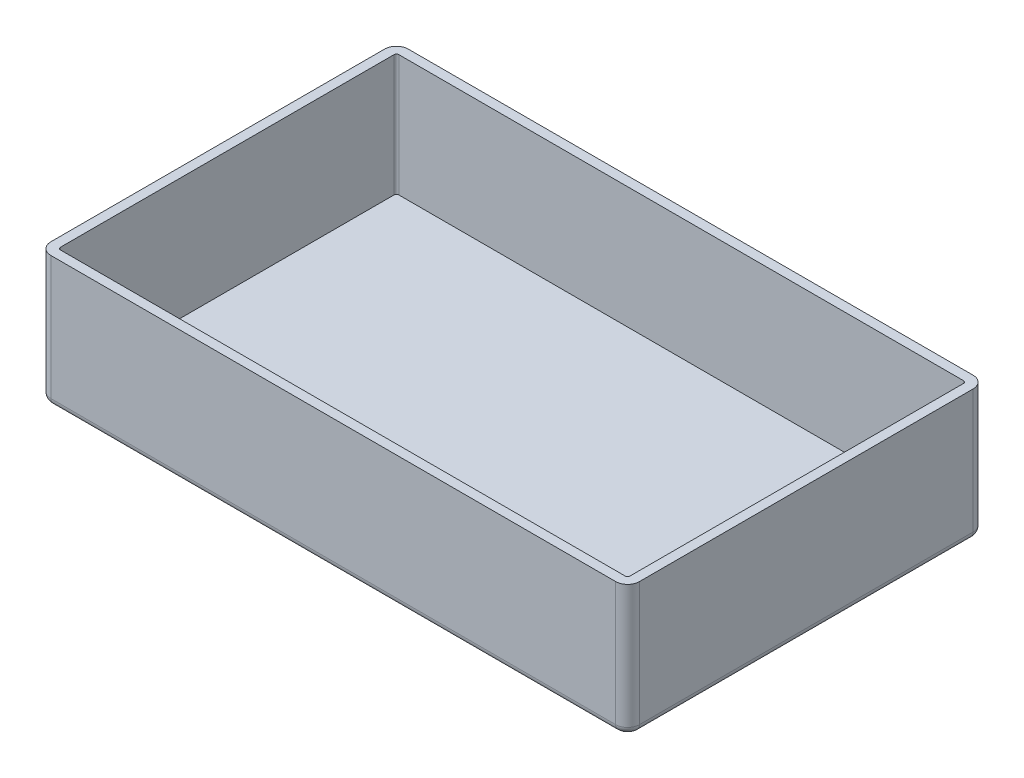
ISO-10303-21;
HEADER;
FILE_DESCRIPTION(('STEP AP214'),'2;1');
FILE_NAME('part.step','',(''),(''),'','','');
FILE_SCHEMA(('AUTOMOTIVE_DESIGN { 1 0 10303 214 1 1 1 1 }'));
ENDSEC;
DATA;
#1=APPLICATION_CONTEXT('core data for automotive mechanical design processes');
#2=APPLICATION_PROTOCOL_DEFINITION('international standard','automotive_design',2000,#1);
#3=PRODUCT_CONTEXT('',#1,'mechanical');
#4=PRODUCT('Part','Part','',(#3));
#5=PRODUCT_RELATED_PRODUCT_CATEGORY('part','',(#4));
#6=PRODUCT_DEFINITION_FORMATION('','',#4);
#7=PRODUCT_DEFINITION_CONTEXT('part definition',#1,'design');
#8=PRODUCT_DEFINITION('design','',#6,#7);
#9=PRODUCT_DEFINITION_SHAPE('','',#8);
#10=(LENGTH_UNIT() NAMED_UNIT(*) SI_UNIT(.MILLI.,.METRE.));
#11=(NAMED_UNIT(*) PLANE_ANGLE_UNIT() SI_UNIT($,.RADIAN.));
#12=(NAMED_UNIT(*) SI_UNIT($,.STERADIAN.) SOLID_ANGLE_UNIT());
#13=UNCERTAINTY_MEASURE_WITH_UNIT(LENGTH_MEASURE(1.E-05),#10,'distance_accuracy_value','');
#14=(GEOMETRIC_REPRESENTATION_CONTEXT(3) GLOBAL_UNCERTAINTY_ASSIGNED_CONTEXT((#13)) GLOBAL_UNIT_ASSIGNED_CONTEXT((#10,
#11,#12)) REPRESENTATION_CONTEXT('',''));
#15=CARTESIAN_POINT('',(0.,0.,0.));
#16=DIRECTION('',(0.,0.,1.));
#17=DIRECTION('',(1.,0.,0.));
#18=AXIS2_PLACEMENT_3D('',#15,#16,#17);
#19=CARTESIAN_POINT('',(123.5,55.,75.));
#20=DIRECTION('',(-1.,0.,0.));
#21=DIRECTION('',(0.,0.,1.));
#22=AXIS2_PLACEMENT_3D('',#19,#20,#21);
#23=PLANE('',#22);
#24=DIRECTION('',(0.,-1.,0.));
#25=VECTOR('',#24,1.);
#26=CARTESIAN_POINT('',(123.5,55.,70.));
#27=LINE('',#26,#25);
#28=CARTESIAN_POINT('',(123.5,55.,70.));
#29=VERTEX_POINT('',#28);
#30=CARTESIAN_POINT('',(123.5,3.,70.));
#31=VERTEX_POINT('',#30);
#32=EDGE_CURVE('E283',#29,#31,#27,.T.);
#33=ORIENTED_EDGE('',*,*,#32,.T.);
#34=DIRECTION('',(0.,0.,-1.));
#35=VECTOR('',#34,1.);
#36=CARTESIAN_POINT('',(123.5,3.,-70.));
#37=LINE('',#36,#35);
#38=CARTESIAN_POINT('',(123.5,3.,-70.));
#39=VERTEX_POINT('',#38);
#40=EDGE_CURVE('E308',#31,#39,#37,.T.);
#41=ORIENTED_EDGE('',*,*,#40,.T.);
#42=DIRECTION('',(0.,-1.,0.));
#43=VECTOR('',#42,1.);
#44=CARTESIAN_POINT('',(123.5,55.,-70.));
#45=LINE('',#44,#43);
#46=CARTESIAN_POINT('',(123.5,55.,-70.));
#47=VERTEX_POINT('',#46);
#48=EDGE_CURVE('E286',#39,#47,#45,.F.);
#49=ORIENTED_EDGE('',*,*,#48,.T.);
#50=DIRECTION('',(0.,0.,-1.));
#51=VECTOR('',#50,1.);
#52=CARTESIAN_POINT('',(123.5,55.,75.));
#53=LINE('',#52,#51);
#54=EDGE_CURVE('E249',#29,#47,#53,.T.);
#55=ORIENTED_EDGE('',*,*,#54,.F.);
#56=EDGE_LOOP('',(#33,#41,#49,#55));
#57=FACE_BOUND('',#56,.T.);
#58=ADVANCED_FACE('F43',(#57),#23,.F.);
#59=CARTESIAN_POINT('',(-123.5,55.,-75.));
#60=DIRECTION('',(0.,0.,1.));
#61=DIRECTION('',(1.,0.,0.));
#62=AXIS2_PLACEMENT_3D('',#59,#60,#61);
#63=PLANE('',#62);
#64=DIRECTION('',(0.,-1.,0.));
#65=VECTOR('',#64,1.);
#66=CARTESIAN_POINT('',(118.5,55.,-75.));
#67=LINE('',#66,#65);
#68=CARTESIAN_POINT('',(118.5,55.,-75.));
#69=VERTEX_POINT('',#68);
#70=CARTESIAN_POINT('',(118.5,3.,-75.));
#71=VERTEX_POINT('',#70);
#72=EDGE_CURVE('E266',#69,#71,#67,.T.);
#73=ORIENTED_EDGE('',*,*,#72,.T.);
#74=DIRECTION('',(-1.,0.,0.));
#75=VECTOR('',#74,1.);
#76=CARTESIAN_POINT('',(-118.5,3.,-75.));
#77=LINE('',#76,#75);
#78=CARTESIAN_POINT('',(-118.5,3.,-75.));
#79=VERTEX_POINT('',#78);
#80=EDGE_CURVE('E11',#71,#79,#77,.T.);
#81=ORIENTED_EDGE('',*,*,#80,.T.);
#82=DIRECTION('',(0.,-1.,0.));
#83=VECTOR('',#82,1.);
#84=CARTESIAN_POINT('',(-118.5,55.,-75.));
#85=LINE('',#84,#83);
#86=CARTESIAN_POINT('',(-118.5,55.,-75.));
#87=VERTEX_POINT('',#86);
#88=EDGE_CURVE('E268',#79,#87,#85,.F.);
#89=ORIENTED_EDGE('',*,*,#88,.T.);
#90=DIRECTION('',(-1.,0.,0.));
#91=VECTOR('',#90,1.);
#92=CARTESIAN_POINT('',(-123.5,55.,-75.));
#93=LINE('',#92,#91);
#94=EDGE_CURVE('E252',#69,#87,#93,.T.);
#95=ORIENTED_EDGE('',*,*,#94,.F.);
#96=EDGE_LOOP('',(#73,#81,#89,#95));
#97=FACE_BOUND('',#96,.T.);
#98=ADVANCED_FACE('F388',(#97),#63,.F.);
#99=CARTESIAN_POINT('',(-123.5,55.,75.));
#100=DIRECTION('',(1.,0.,0.));
#101=DIRECTION('',(0.,0.,-1.));
#102=AXIS2_PLACEMENT_3D('',#99,#100,#101);
#103=PLANE('',#102);
#104=DIRECTION('',(0.,-1.,0.));
#105=VECTOR('',#104,1.);
#106=CARTESIAN_POINT('',(-123.5,55.,-70.));
#107=LINE('',#106,#105);
#108=CARTESIAN_POINT('',(-123.5,55.,-70.));
#109=VERTEX_POINT('',#108);
#110=CARTESIAN_POINT('',(-123.5,3.,-70.));
#111=VERTEX_POINT('',#110);
#112=EDGE_CURVE('E263',#109,#111,#107,.T.);
#113=ORIENTED_EDGE('',*,*,#112,.T.);
#114=DIRECTION('',(0.,0.,1.));
#115=VECTOR('',#114,1.);
#116=CARTESIAN_POINT('',(-123.5,3.,70.));
#117=LINE('',#116,#115);
#118=CARTESIAN_POINT('',(-123.5,3.,70.));
#119=VERTEX_POINT('',#118);
#120=EDGE_CURVE('E316',#111,#119,#117,.T.);
#121=ORIENTED_EDGE('',*,*,#120,.T.);
#122=DIRECTION('',(0.,-1.,0.));
#123=VECTOR('',#122,1.);
#124=CARTESIAN_POINT('',(-123.5,55.,70.));
#125=LINE('',#124,#123);
#126=CARTESIAN_POINT('',(-123.5,55.,70.));
#127=VERTEX_POINT('',#126);
#128=EDGE_CURVE('E261',#119,#127,#125,.F.);
#129=ORIENTED_EDGE('',*,*,#128,.T.);
#130=DIRECTION('',(0.,0.,1.));
#131=VECTOR('',#130,1.);
#132=CARTESIAN_POINT('',(-123.5,55.,75.));
#133=LINE('',#132,#131);
#134=EDGE_CURVE('E255',#109,#127,#133,.T.);
#135=ORIENTED_EDGE('',*,*,#134,.F.);
#136=EDGE_LOOP('',(#113,#121,#129,#135));
#137=FACE_BOUND('',#136,.T.);
#138=ADVANCED_FACE('F396',(#137),#103,.F.);
#139=CARTESIAN_POINT('',(-123.5,55.,75.));
#140=DIRECTION('',(0.,0.,-1.));
#141=DIRECTION('',(-1.,0.,0.));
#142=AXIS2_PLACEMENT_3D('',#139,#140,#141);
#143=PLANE('',#142);
#144=DIRECTION('',(0.,-1.,0.));
#145=VECTOR('',#144,1.);
#146=CARTESIAN_POINT('',(-118.5,55.,75.));
#147=LINE('',#146,#145);
#148=CARTESIAN_POINT('',(-118.5,55.,75.));
#149=VERTEX_POINT('',#148);
#150=CARTESIAN_POINT('',(-118.5,3.,75.));
#151=VERTEX_POINT('',#150);
#152=EDGE_CURVE('E280',#149,#151,#147,.T.);
#153=ORIENTED_EDGE('',*,*,#152,.T.);
#154=DIRECTION('',(1.,0.,0.));
#155=VECTOR('',#154,1.);
#156=CARTESIAN_POINT('',(118.5,3.,75.));
#157=LINE('',#156,#155);
#158=CARTESIAN_POINT('',(118.5,3.,75.));
#159=VERTEX_POINT('',#158);
#160=EDGE_CURVE('E312',#151,#159,#157,.T.);
#161=ORIENTED_EDGE('',*,*,#160,.T.);
#162=DIRECTION('',(0.,-1.,0.));
#163=VECTOR('',#162,1.);
#164=CARTESIAN_POINT('',(118.5,55.,75.));
#165=LINE('',#164,#163);
#166=CARTESIAN_POINT('',(118.5,55.,75.));
#167=VERTEX_POINT('',#166);
#168=EDGE_CURVE('E278',#159,#167,#165,.F.);
#169=ORIENTED_EDGE('',*,*,#168,.T.);
#170=DIRECTION('',(1.,0.,0.));
#171=VECTOR('',#170,1.);
#172=CARTESIAN_POINT('',(-123.5,55.,75.));
#173=LINE('',#172,#171);
#174=EDGE_CURVE('E258',#149,#167,#173,.T.);
#175=ORIENTED_EDGE('',*,*,#174,.F.);
#176=EDGE_LOOP('',(#153,#161,#169,#175));
#177=FACE_BOUND('',#176,.T.);
#178=ADVANCED_FACE('F356',(#177),#143,.F.);
#179=CARTESIAN_POINT('',(0.,55.,0.));
#180=DIRECTION('',(0.,-1.,0.));
#181=DIRECTION('',(0.,0.,-1.));
#182=AXIS2_PLACEMENT_3D('',#179,#180,#181);
#183=PLANE('',#182);
#184=DIRECTION('',(-1.,0.,0.));
#185=VECTOR('',#184,1.);
#186=CARTESIAN_POINT('',(0.,55.,-71.));
#187=LINE('',#186,#185);
#188=CARTESIAN_POINT('',(118.5,55.,-71.));
#189=VERTEX_POINT('',#188);
#190=CARTESIAN_POINT('',(-118.5,55.,-71.));
#191=VERTEX_POINT('',#190);
#192=EDGE_CURVE('E235',#189,#191,#187,.T.);
#193=ORIENTED_EDGE('',*,*,#192,.F.);
#194=CARTESIAN_POINT('',(118.5,55.,-70.));
#195=DIRECTION('',(0.,-1.,0.));
#196=DIRECTION('',(0.,0.,-1.));
#197=AXIS2_PLACEMENT_3D('',#194,#195,#196);
#198=CIRCLE('',#197,1.);
#199=CARTESIAN_POINT('',(119.5,55.,-70.));
#200=VERTEX_POINT('',#199);
#201=EDGE_CURVE('E236',#200,#189,#198,.F.);
#202=ORIENTED_EDGE('',*,*,#201,.F.);
#203=DIRECTION('',(0.,0.,-1.));
#204=VECTOR('',#203,1.);
#205=CARTESIAN_POINT('',(119.5,55.,0.));
#206=LINE('',#205,#204);
#207=CARTESIAN_POINT('',(119.5,55.,70.));
#208=VERTEX_POINT('',#207);
#209=EDGE_CURVE('E60',#208,#200,#206,.T.);
#210=ORIENTED_EDGE('',*,*,#209,.F.);
#211=CARTESIAN_POINT('',(118.5,55.,70.));
#212=DIRECTION('',(0.,-1.,0.));
#213=DIRECTION('',(0.,0.,-1.));
#214=AXIS2_PLACEMENT_3D('',#211,#212,#213);
#215=CIRCLE('',#214,1.);
#216=CARTESIAN_POINT('',(118.5,55.,71.));
#217=VERTEX_POINT('',#216);
#218=EDGE_CURVE('E202',#217,#208,#215,.F.);
#219=ORIENTED_EDGE('',*,*,#218,.F.);
#220=DIRECTION('',(1.,0.,0.));
#221=VECTOR('',#220,1.);
#222=CARTESIAN_POINT('',(0.,55.,71.));
#223=LINE('',#222,#221);
#224=CARTESIAN_POINT('',(-118.5,55.,71.));
#225=VERTEX_POINT('',#224);
#226=EDGE_CURVE('E230',#225,#217,#223,.T.);
#227=ORIENTED_EDGE('',*,*,#226,.F.);
#228=CARTESIAN_POINT('',(-118.5,55.,70.));
#229=DIRECTION('',(0.,-1.,0.));
#230=DIRECTION('',(0.,0.,-1.));
#231=AXIS2_PLACEMENT_3D('',#228,#229,#230);
#232=CIRCLE('',#231,1.);
#233=CARTESIAN_POINT('',(-119.5,55.,70.));
#234=VERTEX_POINT('',#233);
#235=EDGE_CURVE('E238',#234,#225,#232,.F.);
#236=ORIENTED_EDGE('',*,*,#235,.F.);
#237=DIRECTION('',(0.,0.,1.));
#238=VECTOR('',#237,1.);
#239=CARTESIAN_POINT('',(-119.5,55.,0.));
#240=LINE('',#239,#238);
#241=CARTESIAN_POINT('',(-119.5,55.,-70.));
#242=VERTEX_POINT('',#241);
#243=EDGE_CURVE('E241',#242,#234,#240,.T.);
#244=ORIENTED_EDGE('',*,*,#243,.F.);
#245=CARTESIAN_POINT('',(-118.5,55.,-70.));
#246=DIRECTION('',(0.,-1.,0.));
#247=DIRECTION('',(0.,0.,-1.));
#248=AXIS2_PLACEMENT_3D('',#245,#246,#247);
#249=CIRCLE('',#248,1.);
#250=EDGE_CURVE('E233',#191,#242,#249,.F.);
#251=ORIENTED_EDGE('',*,*,#250,.F.);
#252=EDGE_LOOP('',(#193,#202,#210,#219,#227,#236,#244,#251));
#253=FACE_BOUND('',#252,.T.);
#254=ORIENTED_EDGE('',*,*,#94,.T.);
#255=CARTESIAN_POINT('',(-118.5,55.,-70.));
#256=DIRECTION('',(0.,-1.,0.));
#257=DIRECTION('',(0.,0.,-1.));
#258=AXIS2_PLACEMENT_3D('',#255,#256,#257);
#259=CIRCLE('',#258,5.);
#260=EDGE_CURVE('E276',#87,#109,#259,.F.);
#261=ORIENTED_EDGE('',*,*,#260,.T.);
#262=ORIENTED_EDGE('',*,*,#134,.T.);
#263=CARTESIAN_POINT('',(-118.5,55.,70.));
#264=DIRECTION('',(0.,-1.,0.));
#265=DIRECTION('',(0.,0.,-1.));
#266=AXIS2_PLACEMENT_3D('',#263,#264,#265);
#267=CIRCLE('',#266,5.);
#268=EDGE_CURVE('E274',#127,#149,#267,.F.);
#269=ORIENTED_EDGE('',*,*,#268,.T.);
#270=ORIENTED_EDGE('',*,*,#174,.T.);
#271=CARTESIAN_POINT('',(118.5,55.,70.));
#272=DIRECTION('',(0.,-1.,0.));
#273=DIRECTION('',(0.,0.,-1.));
#274=AXIS2_PLACEMENT_3D('',#271,#272,#273);
#275=CIRCLE('',#274,5.);
#276=EDGE_CURVE('E270',#167,#29,#275,.F.);
#277=ORIENTED_EDGE('',*,*,#276,.T.);
#278=ORIENTED_EDGE('',*,*,#54,.T.);
#279=CARTESIAN_POINT('',(118.5,55.,-70.));
#280=DIRECTION('',(0.,-1.,0.));
#281=DIRECTION('',(0.,0.,-1.));
#282=AXIS2_PLACEMENT_3D('',#279,#280,#281);
#283=CIRCLE('',#282,5.);
#284=EDGE_CURVE('E272',#47,#69,#283,.F.);
#285=ORIENTED_EDGE('',*,*,#284,.T.);
#286=EDGE_LOOP('',(#254,#261,#262,#269,#270,#277,#278,#285));
#287=FACE_BOUND('',#286,.T.);
#288=ADVANCED_FACE('F360',(#253,#287),#183,.F.);
#289=CARTESIAN_POINT('',(0.,0.,0.));
#290=DIRECTION('',(0.,-1.,0.));
#291=DIRECTION('',(0.,0.,-1.));
#292=AXIS2_PLACEMENT_3D('',#289,#290,#291);
#293=PLANE('',#292);
#294=DIRECTION('',(-1.,0.,0.));
#295=VECTOR('',#294,1.);
#296=CARTESIAN_POINT('',(118.5,0.,-72.));
#297=LINE('',#296,#295);
#298=CARTESIAN_POINT('',(-118.5,0.,-72.));
#299=VERTEX_POINT('',#298);
#300=CARTESIAN_POINT('',(118.5,0.,-72.));
#301=VERTEX_POINT('',#300);
#302=EDGE_CURVE('E288',#299,#301,#297,.F.);
#303=ORIENTED_EDGE('',*,*,#302,.T.);
#304=CARTESIAN_POINT('',(118.5,0.,-70.));
#305=DIRECTION('',(0.,-1.,0.));
#306=DIRECTION('',(0.,0.,-1.));
#307=AXIS2_PLACEMENT_3D('',#304,#305,#306);
#308=CIRCLE('',#307,2.);
#309=CARTESIAN_POINT('',(120.5,0.,-70.));
#310=VERTEX_POINT('',#309);
#311=EDGE_CURVE('E302',#301,#310,#308,.T.);
#312=ORIENTED_EDGE('',*,*,#311,.T.);
#313=DIRECTION('',(0.,0.,-1.));
#314=VECTOR('',#313,1.);
#315=CARTESIAN_POINT('',(120.5,0.,70.));
#316=LINE('',#315,#314);
#317=CARTESIAN_POINT('',(120.5,0.,70.));
#318=VERTEX_POINT('',#317);
#319=EDGE_CURVE('E300',#310,#318,#316,.F.);
#320=ORIENTED_EDGE('',*,*,#319,.T.);
#321=CARTESIAN_POINT('',(118.5,0.,70.));
#322=DIRECTION('',(0.,-1.,0.));
#323=DIRECTION('',(0.,0.,-1.));
#324=AXIS2_PLACEMENT_3D('',#321,#322,#323);
#325=CIRCLE('',#324,2.);
#326=CARTESIAN_POINT('',(118.5,0.,72.));
#327=VERTEX_POINT('',#326);
#328=EDGE_CURVE('E298',#318,#327,#325,.T.);
#329=ORIENTED_EDGE('',*,*,#328,.T.);
#330=DIRECTION('',(1.,0.,0.));
#331=VECTOR('',#330,1.);
#332=CARTESIAN_POINT('',(-118.5,0.,72.));
#333=LINE('',#332,#331);
#334=CARTESIAN_POINT('',(-118.5,0.,72.));
#335=VERTEX_POINT('',#334);
#336=EDGE_CURVE('E296',#327,#335,#333,.F.);
#337=ORIENTED_EDGE('',*,*,#336,.T.);
#338=CARTESIAN_POINT('',(-118.5,0.,70.));
#339=DIRECTION('',(0.,-1.,0.));
#340=DIRECTION('',(0.,0.,-1.));
#341=AXIS2_PLACEMENT_3D('',#338,#339,#340);
#342=CIRCLE('',#341,2.);
#343=CARTESIAN_POINT('',(-120.5,0.,70.));
#344=VERTEX_POINT('',#343);
#345=EDGE_CURVE('E294',#335,#344,#342,.T.);
#346=ORIENTED_EDGE('',*,*,#345,.T.);
#347=DIRECTION('',(0.,0.,1.));
#348=VECTOR('',#347,1.);
#349=CARTESIAN_POINT('',(-120.5,0.,-70.));
#350=LINE('',#349,#348);
#351=CARTESIAN_POINT('',(-120.5,0.,-70.));
#352=VERTEX_POINT('',#351);
#353=EDGE_CURVE('E292',#344,#352,#350,.F.);
#354=ORIENTED_EDGE('',*,*,#353,.T.);
#355=CARTESIAN_POINT('',(-118.5,0.,-70.));
#356=DIRECTION('',(0.,-1.,0.));
#357=DIRECTION('',(0.,0.,-1.));
#358=AXIS2_PLACEMENT_3D('',#355,#356,#357);
#359=CIRCLE('',#358,2.);
#360=EDGE_CURVE('E290',#352,#299,#359,.T.);
#361=ORIENTED_EDGE('',*,*,#360,.T.);
#362=EDGE_LOOP('',(#303,#312,#320,#329,#337,#346,#354,#361));
#363=FACE_BOUND('',#362,.T.);
#364=ADVANCED_FACE('F412',(#363),#293,.T.);
#365=CARTESIAN_POINT('',(-118.5,55.,-70.));
#366=DIRECTION('',(0.,-1.,0.));
#367=DIRECTION('',(0.,0.,-1.));
#368=AXIS2_PLACEMENT_3D('',#365,#366,#367);
#369=CYLINDRICAL_SURFACE('',#368,5.);
#370=ORIENTED_EDGE('',*,*,#88,.F.);
#371=CARTESIAN_POINT('',(-118.5,3.,-70.));
#372=DIRECTION('',(0.,-1.,0.));
#373=DIRECTION('',(0.,0.,-1.));
#374=AXIS2_PLACEMENT_3D('',#371,#372,#373);
#375=CIRCLE('',#374,5.);
#376=EDGE_CURVE('E52',#79,#111,#375,.F.);
#377=ORIENTED_EDGE('',*,*,#376,.T.);
#378=ORIENTED_EDGE('',*,*,#112,.F.);
#379=ORIENTED_EDGE('',*,*,#260,.F.);
#380=EDGE_LOOP('',(#370,#377,#378,#379));
#381=FACE_BOUND('',#380,.T.);
#382=ADVANCED_FACE('F393',(#381),#369,.T.);
#383=CARTESIAN_POINT('',(-118.5,55.,70.));
#384=DIRECTION('',(0.,-1.,0.));
#385=DIRECTION('',(0.,0.,-1.));
#386=AXIS2_PLACEMENT_3D('',#383,#384,#385);
#387=CYLINDRICAL_SURFACE('',#386,5.);
#388=ORIENTED_EDGE('',*,*,#128,.F.);
#389=CARTESIAN_POINT('',(-118.5,3.,70.));
#390=DIRECTION('',(0.,-1.,0.));
#391=DIRECTION('',(0.,0.,-1.));
#392=AXIS2_PLACEMENT_3D('',#389,#390,#391);
#393=CIRCLE('',#392,5.);
#394=EDGE_CURVE('E314',#119,#151,#393,.F.);
#395=ORIENTED_EDGE('',*,*,#394,.T.);
#396=ORIENTED_EDGE('',*,*,#152,.F.);
#397=ORIENTED_EDGE('',*,*,#268,.F.);
#398=EDGE_LOOP('',(#388,#395,#396,#397));
#399=FACE_BOUND('',#398,.T.);
#400=ADVANCED_FACE('F352',(#399),#387,.T.);
#401=CARTESIAN_POINT('',(118.5,55.,-70.));
#402=DIRECTION('',(0.,-1.,0.));
#403=DIRECTION('',(0.,0.,-1.));
#404=AXIS2_PLACEMENT_3D('',#401,#402,#403);
#405=CYLINDRICAL_SURFACE('',#404,5.);
#406=ORIENTED_EDGE('',*,*,#48,.F.);
#407=CARTESIAN_POINT('',(118.5,3.,-70.));
#408=DIRECTION('',(0.,-1.,0.));
#409=DIRECTION('',(0.,0.,-1.));
#410=AXIS2_PLACEMENT_3D('',#407,#408,#409);
#411=CIRCLE('',#410,5.);
#412=EDGE_CURVE('E305',#39,#71,#411,.F.);
#413=ORIENTED_EDGE('',*,*,#412,.T.);
#414=ORIENTED_EDGE('',*,*,#72,.F.);
#415=ORIENTED_EDGE('',*,*,#284,.F.);
#416=EDGE_LOOP('',(#406,#413,#414,#415));
#417=FACE_BOUND('',#416,.T.);
#418=ADVANCED_FACE('F385',(#417),#405,.T.);
#419=CARTESIAN_POINT('',(118.5,55.,70.));
#420=DIRECTION('',(0.,-1.,0.));
#421=DIRECTION('',(0.,0.,-1.));
#422=AXIS2_PLACEMENT_3D('',#419,#420,#421);
#423=CYLINDRICAL_SURFACE('',#422,5.);
#424=ORIENTED_EDGE('',*,*,#168,.F.);
#425=CARTESIAN_POINT('',(118.5,3.,70.));
#426=DIRECTION('',(0.,-1.,0.));
#427=DIRECTION('',(0.,0.,-1.));
#428=AXIS2_PLACEMENT_3D('',#425,#426,#427);
#429=CIRCLE('',#428,5.);
#430=EDGE_CURVE('E310',#159,#31,#429,.F.);
#431=ORIENTED_EDGE('',*,*,#430,.T.);
#432=ORIENTED_EDGE('',*,*,#32,.F.);
#433=ORIENTED_EDGE('',*,*,#276,.F.);
#434=EDGE_LOOP('',(#424,#431,#432,#433));
#435=FACE_BOUND('',#434,.T.);
#436=ADVANCED_FACE('F364',(#435),#423,.T.);
#437=CARTESIAN_POINT('',(-118.5,3.,70.));
#438=DIRECTION('',(0.,-1.,0.));
#439=DIRECTION('',(0.,0.,-1.));
#440=AXIS2_PLACEMENT_3D('',#437,#438,#439);
#441=DEGENERATE_TOROIDAL_SURFACE('',#440,2.,3.,.T.);
#442=CARTESIAN_POINT('',(-118.5,3.,72.));
#443=DIRECTION('',(1.,0.,0.));
#444=DIRECTION('',(0.,0.,-1.));
#445=AXIS2_PLACEMENT_3D('',#442,#443,#444);
#446=CIRCLE('',#445,3.);
#447=EDGE_CURVE('E333',#151,#335,#446,.T.);
#448=ORIENTED_EDGE('',*,*,#447,.F.);
#449=ORIENTED_EDGE('',*,*,#394,.F.);
#450=CARTESIAN_POINT('',(-120.5,3.,70.));
#451=DIRECTION('',(0.,0.,-1.));
#452=DIRECTION('',(-1.,0.,0.));
#453=AXIS2_PLACEMENT_3D('',#450,#451,#452);
#454=CIRCLE('',#453,3.);
#455=EDGE_CURVE('E47',#344,#119,#454,.T.);
#456=ORIENTED_EDGE('',*,*,#455,.F.);
#457=ORIENTED_EDGE('',*,*,#345,.F.);
#458=EDGE_LOOP('',(#448,#449,#456,#457));
#459=FACE_BOUND('',#458,.T.);
#460=ADVANCED_FACE('F45',(#459),#441,.T.);
#461=CARTESIAN_POINT('',(-120.5,3.,75.));
#462=DIRECTION('',(0.,0.,-1.));
#463=DIRECTION('',(-1.,0.,0.));
#464=AXIS2_PLACEMENT_3D('',#461,#462,#463);
#465=CYLINDRICAL_SURFACE('',#464,3.);
#466=ORIENTED_EDGE('',*,*,#455,.T.);
#467=ORIENTED_EDGE('',*,*,#120,.F.);
#468=CARTESIAN_POINT('',(-120.5,3.,-70.));
#469=DIRECTION('',(0.,0.,-1.));
#470=DIRECTION('',(-1.,0.,0.));
#471=AXIS2_PLACEMENT_3D('',#468,#469,#470);
#472=CIRCLE('',#471,3.);
#473=EDGE_CURVE('E331',#352,#111,#472,.T.);
#474=ORIENTED_EDGE('',*,*,#473,.F.);
#475=ORIENTED_EDGE('',*,*,#353,.F.);
#476=EDGE_LOOP('',(#466,#467,#474,#475));
#477=FACE_BOUND('',#476,.T.);
#478=ADVANCED_FACE('F344',(#477),#465,.T.);
#479=CARTESIAN_POINT('',(-123.5,3.,72.));
#480=DIRECTION('',(-1.,0.,0.));
#481=DIRECTION('',(0.,0.,1.));
#482=AXIS2_PLACEMENT_3D('',#479,#480,#481);
#483=CYLINDRICAL_SURFACE('',#482,3.);
#484=ORIENTED_EDGE('',*,*,#447,.T.);
#485=ORIENTED_EDGE('',*,*,#336,.F.);
#486=CARTESIAN_POINT('',(118.5,3.,72.));
#487=DIRECTION('',(1.,0.,0.));
#488=DIRECTION('',(0.,0.,-1.));
#489=AXIS2_PLACEMENT_3D('',#486,#487,#488);
#490=CIRCLE('',#489,3.);
#491=EDGE_CURVE('E328',#159,#327,#490,.T.);
#492=ORIENTED_EDGE('',*,*,#491,.F.);
#493=ORIENTED_EDGE('',*,*,#160,.F.);
#494=EDGE_LOOP('',(#484,#485,#492,#493));
#495=FACE_BOUND('',#494,.T.);
#496=ADVANCED_FACE('F432',(#495),#483,.T.);
#497=CARTESIAN_POINT('',(-118.5,3.,-70.));
#498=DIRECTION('',(0.,-1.,0.));
#499=DIRECTION('',(0.,0.,-1.));
#500=AXIS2_PLACEMENT_3D('',#497,#498,#499);
#501=DEGENERATE_TOROIDAL_SURFACE('',#500,2.,3.,.T.);
#502=ORIENTED_EDGE('',*,*,#473,.T.);
#503=ORIENTED_EDGE('',*,*,#376,.F.);
#504=CARTESIAN_POINT('',(-118.5,3.,-72.));
#505=DIRECTION('',(1.,0.,0.));
#506=DIRECTION('',(0.,0.,-1.));
#507=AXIS2_PLACEMENT_3D('',#504,#505,#506);
#508=CIRCLE('',#507,3.);
#509=EDGE_CURVE('E325',#299,#79,#508,.T.);
#510=ORIENTED_EDGE('',*,*,#509,.F.);
#511=ORIENTED_EDGE('',*,*,#360,.F.);
#512=EDGE_LOOP('',(#502,#503,#510,#511));
#513=FACE_BOUND('',#512,.T.);
#514=ADVANCED_FACE('F429',(#513),#501,.T.);
#515=CARTESIAN_POINT('',(118.5,3.,70.));
#516=DIRECTION('',(0.,-1.,0.));
#517=DIRECTION('',(0.,0.,-1.));
#518=AXIS2_PLACEMENT_3D('',#515,#516,#517);
#519=DEGENERATE_TOROIDAL_SURFACE('',#518,2.,3.,.T.);
#520=ORIENTED_EDGE('',*,*,#491,.T.);
#521=ORIENTED_EDGE('',*,*,#328,.F.);
#522=CARTESIAN_POINT('',(120.5,3.,70.));
#523=DIRECTION('',(0.,0.,-1.));
#524=DIRECTION('',(-1.,0.,0.));
#525=AXIS2_PLACEMENT_3D('',#522,#523,#524);
#526=CIRCLE('',#525,3.);
#527=EDGE_CURVE('E322',#31,#318,#526,.T.);
#528=ORIENTED_EDGE('',*,*,#527,.F.);
#529=ORIENTED_EDGE('',*,*,#430,.F.);
#530=EDGE_LOOP('',(#520,#521,#528,#529));
#531=FACE_BOUND('',#530,.T.);
#532=ADVANCED_FACE('F373',(#531),#519,.T.);
#533=CARTESIAN_POINT('',(-123.5,3.,-72.));
#534=DIRECTION('',(1.,0.,0.));
#535=DIRECTION('',(0.,0.,-1.));
#536=AXIS2_PLACEMENT_3D('',#533,#534,#535);
#537=CYLINDRICAL_SURFACE('',#536,3.);
#538=ORIENTED_EDGE('',*,*,#509,.T.);
#539=ORIENTED_EDGE('',*,*,#80,.F.);
#540=CARTESIAN_POINT('',(118.5,3.,-72.));
#541=DIRECTION('',(1.,0.,0.));
#542=DIRECTION('',(0.,0.,-1.));
#543=AXIS2_PLACEMENT_3D('',#540,#541,#542);
#544=CIRCLE('',#543,3.);
#545=EDGE_CURVE('E320',#301,#71,#544,.T.);
#546=ORIENTED_EDGE('',*,*,#545,.F.);
#547=ORIENTED_EDGE('',*,*,#302,.F.);
#548=EDGE_LOOP('',(#538,#539,#546,#547));
#549=FACE_BOUND('',#548,.T.);
#550=ADVANCED_FACE('F423',(#549),#537,.T.);
#551=CARTESIAN_POINT('',(120.5,3.,75.));
#552=DIRECTION('',(0.,0.,1.));
#553=DIRECTION('',(1.,0.,0.));
#554=AXIS2_PLACEMENT_3D('',#551,#552,#553);
#555=CYLINDRICAL_SURFACE('',#554,3.);
#556=ORIENTED_EDGE('',*,*,#527,.T.);
#557=ORIENTED_EDGE('',*,*,#319,.F.);
#558=CARTESIAN_POINT('',(120.5,3.,-70.));
#559=DIRECTION('',(0.,0.,-1.));
#560=DIRECTION('',(-1.,0.,0.));
#561=AXIS2_PLACEMENT_3D('',#558,#559,#560);
#562=CIRCLE('',#561,3.);
#563=EDGE_CURVE('E212',#39,#310,#562,.T.);
#564=ORIENTED_EDGE('',*,*,#563,.F.);
#565=ORIENTED_EDGE('',*,*,#40,.F.);
#566=EDGE_LOOP('',(#556,#557,#564,#565));
#567=FACE_BOUND('',#566,.T.);
#568=ADVANCED_FACE('F377',(#567),#555,.T.);
#569=CARTESIAN_POINT('',(118.5,3.,-70.));
#570=DIRECTION('',(0.,-1.,0.));
#571=DIRECTION('',(0.,0.,-1.));
#572=AXIS2_PLACEMENT_3D('',#569,#570,#571);
#573=DEGENERATE_TOROIDAL_SURFACE('',#572,2.,3.,.T.);
#574=ORIENTED_EDGE('',*,*,#545,.T.);
#575=ORIENTED_EDGE('',*,*,#412,.F.);
#576=ORIENTED_EDGE('',*,*,#563,.T.);
#577=ORIENTED_EDGE('',*,*,#311,.F.);
#578=EDGE_LOOP('',(#574,#575,#576,#577));
#579=FACE_BOUND('',#578,.T.);
#580=ADVANCED_FACE('F381',(#579),#573,.T.);
#581=CARTESIAN_POINT('',(119.5,55.,75.));
#582=DIRECTION('',(-1.,0.,0.));
#583=DIRECTION('',(0.,0.,1.));
#584=AXIS2_PLACEMENT_3D('',#581,#582,#583);
#585=PLANE('',#584);
#586=DIRECTION('',(0.,1.,0.));
#587=VECTOR('',#586,1.);
#588=CARTESIAN_POINT('',(119.5,55.,70.));
#589=LINE('',#588,#587);
#590=CARTESIAN_POINT('',(119.5,4.,70.));
#591=VERTEX_POINT('',#590);
#592=EDGE_CURVE('E185',#208,#591,#589,.F.);
#593=ORIENTED_EDGE('',*,*,#592,.F.);
#594=ORIENTED_EDGE('',*,*,#209,.T.);
#595=DIRECTION('',(0.,1.,0.));
#596=VECTOR('',#595,1.);
#597=CARTESIAN_POINT('',(119.5,55.,-70.));
#598=LINE('',#597,#596);
#599=CARTESIAN_POINT('',(119.5,4.,-70.));
#600=VERTEX_POINT('',#599);
#601=EDGE_CURVE('E186',#600,#200,#598,.T.);
#602=ORIENTED_EDGE('',*,*,#601,.F.);
#603=DIRECTION('',(0.,0.,1.));
#604=VECTOR('',#603,1.);
#605=CARTESIAN_POINT('',(119.5,4.,75.));
#606=LINE('',#605,#604);
#607=EDGE_CURVE('E181',#600,#591,#606,.T.);
#608=ORIENTED_EDGE('',*,*,#607,.T.);
#609=EDGE_LOOP('',(#593,#594,#602,#608));
#610=FACE_BOUND('',#609,.T.);
#611=ADVANCED_FACE('F183',(#610),#585,.T.);
#612=CARTESIAN_POINT('',(-123.5,55.,-71.));
#613=DIRECTION('',(0.,0.,1.));
#614=DIRECTION('',(1.,0.,0.));
#615=AXIS2_PLACEMENT_3D('',#612,#613,#614);
#616=PLANE('',#615);
#617=DIRECTION('',(0.,1.,0.));
#618=VECTOR('',#617,1.);
#619=CARTESIAN_POINT('',(118.5,55.,-71.));
#620=LINE('',#619,#618);
#621=CARTESIAN_POINT('',(118.5,4.,-71.));
#622=VERTEX_POINT('',#621);
#623=EDGE_CURVE('E223',#189,#622,#620,.F.);
#624=ORIENTED_EDGE('',*,*,#623,.F.);
#625=ORIENTED_EDGE('',*,*,#192,.T.);
#626=DIRECTION('',(0.,1.,0.));
#627=VECTOR('',#626,1.);
#628=CARTESIAN_POINT('',(-118.5,55.,-71.));
#629=LINE('',#628,#627);
#630=CARTESIAN_POINT('',(-118.5,4.,-71.));
#631=VERTEX_POINT('',#630);
#632=EDGE_CURVE('E225',#631,#191,#629,.T.);
#633=ORIENTED_EDGE('',*,*,#632,.F.);
#634=DIRECTION('',(-1.,0.,0.));
#635=VECTOR('',#634,1.);
#636=CARTESIAN_POINT('',(0.,4.,-71.));
#637=LINE('',#636,#635);
#638=EDGE_CURVE('E210',#622,#631,#637,.T.);
#639=ORIENTED_EDGE('',*,*,#638,.F.);
#640=EDGE_LOOP('',(#624,#625,#633,#639));
#641=FACE_BOUND('',#640,.T.);
#642=ADVANCED_FACE('F497',(#641),#616,.T.);
#643=CARTESIAN_POINT('',(-119.5,55.,75.));
#644=DIRECTION('',(1.,0.,0.));
#645=DIRECTION('',(0.,0.,-1.));
#646=AXIS2_PLACEMENT_3D('',#643,#644,#645);
#647=PLANE('',#646);
#648=DIRECTION('',(0.,1.,0.));
#649=VECTOR('',#648,1.);
#650=CARTESIAN_POINT('',(-119.5,55.,-70.));
#651=LINE('',#650,#649);
#652=CARTESIAN_POINT('',(-119.5,4.,-70.));
#653=VERTEX_POINT('',#652);
#654=EDGE_CURVE('E226',#242,#653,#651,.F.);
#655=ORIENTED_EDGE('',*,*,#654,.F.);
#656=ORIENTED_EDGE('',*,*,#243,.T.);
#657=DIRECTION('',(0.,1.,0.));
#658=VECTOR('',#657,1.);
#659=CARTESIAN_POINT('',(-119.5,55.,70.));
#660=LINE('',#659,#658);
#661=CARTESIAN_POINT('',(-119.5,4.,70.));
#662=VERTEX_POINT('',#661);
#663=EDGE_CURVE('E229',#662,#234,#660,.T.);
#664=ORIENTED_EDGE('',*,*,#663,.F.);
#665=DIRECTION('',(0.,0.,1.));
#666=VECTOR('',#665,1.);
#667=CARTESIAN_POINT('',(-119.5,4.,0.));
#668=LINE('',#667,#666);
#669=EDGE_CURVE('E218',#653,#662,#668,.T.);
#670=ORIENTED_EDGE('',*,*,#669,.F.);
#671=EDGE_LOOP('',(#655,#656,#664,#670));
#672=FACE_BOUND('',#671,.T.);
#673=ADVANCED_FACE('F505',(#672),#647,.T.);
#674=CARTESIAN_POINT('',(-123.5,55.,71.));
#675=DIRECTION('',(0.,0.,-1.));
#676=DIRECTION('',(-1.,0.,0.));
#677=AXIS2_PLACEMENT_3D('',#674,#675,#676);
#678=PLANE('',#677);
#679=DIRECTION('',(0.,1.,0.));
#680=VECTOR('',#679,1.);
#681=CARTESIAN_POINT('',(-118.5,55.,71.));
#682=LINE('',#681,#680);
#683=CARTESIAN_POINT('',(-118.5,4.,71.));
#684=VERTEX_POINT('',#683);
#685=EDGE_CURVE('E203',#225,#684,#682,.F.);
#686=ORIENTED_EDGE('',*,*,#685,.F.);
#687=ORIENTED_EDGE('',*,*,#226,.T.);
#688=DIRECTION('',(0.,1.,0.));
#689=VECTOR('',#688,1.);
#690=CARTESIAN_POINT('',(118.5,55.,71.));
#691=LINE('',#690,#689);
#692=CARTESIAN_POINT('',(118.5,4.,71.));
#693=VERTEX_POINT('',#692);
#694=EDGE_CURVE('E207',#693,#217,#691,.T.);
#695=ORIENTED_EDGE('',*,*,#694,.F.);
#696=DIRECTION('',(-1.,0.,0.));
#697=VECTOR('',#696,1.);
#698=CARTESIAN_POINT('',(-123.5,4.,71.));
#699=LINE('',#698,#697);
#700=EDGE_CURVE('E196',#693,#684,#699,.T.);
#701=ORIENTED_EDGE('',*,*,#700,.T.);
#702=EDGE_LOOP('',(#686,#687,#695,#701));
#703=FACE_BOUND('',#702,.T.);
#704=ADVANCED_FACE('F514',(#703),#678,.T.);
#705=CARTESIAN_POINT('',(0.,4.,0.));
#706=DIRECTION('',(0.,-1.,0.));
#707=DIRECTION('',(0.,0.,-1.));
#708=AXIS2_PLACEMENT_3D('',#705,#706,#707);
#709=PLANE('',#708);
#710=ORIENTED_EDGE('',*,*,#638,.T.);
#711=CARTESIAN_POINT('',(-118.5,4.,-70.));
#712=DIRECTION('',(0.,-1.,0.));
#713=DIRECTION('',(0.,0.,-1.));
#714=AXIS2_PLACEMENT_3D('',#711,#712,#713);
#715=CIRCLE('',#714,1.);
#716=EDGE_CURVE('E213',#631,#653,#715,.F.);
#717=ORIENTED_EDGE('',*,*,#716,.T.);
#718=ORIENTED_EDGE('',*,*,#669,.T.);
#719=CARTESIAN_POINT('',(-118.5,4.,70.));
#720=DIRECTION('',(0.,-1.,0.));
#721=DIRECTION('',(0.,0.,-1.));
#722=AXIS2_PLACEMENT_3D('',#719,#720,#721);
#723=CIRCLE('',#722,1.);
#724=EDGE_CURVE('E214',#662,#684,#723,.F.);
#725=ORIENTED_EDGE('',*,*,#724,.T.);
#726=ORIENTED_EDGE('',*,*,#700,.F.);
#727=CARTESIAN_POINT('',(118.5,4.,70.));
#728=DIRECTION('',(0.,-1.,0.));
#729=DIRECTION('',(0.,0.,-1.));
#730=AXIS2_PLACEMENT_3D('',#727,#728,#729);
#731=CIRCLE('',#730,1.);
#732=EDGE_CURVE('E190',#591,#693,#731,.T.);
#733=ORIENTED_EDGE('',*,*,#732,.F.);
#734=ORIENTED_EDGE('',*,*,#607,.F.);
#735=CARTESIAN_POINT('',(118.5,4.,-70.));
#736=DIRECTION('',(0.,-1.,0.));
#737=DIRECTION('',(0.,0.,-1.));
#738=AXIS2_PLACEMENT_3D('',#735,#736,#737);
#739=CIRCLE('',#738,1.);
#740=EDGE_CURVE('E189',#600,#622,#739,.F.);
#741=ORIENTED_EDGE('',*,*,#740,.T.);
#742=EDGE_LOOP('',(#710,#717,#718,#725,#726,#733,#734,#741));
#743=FACE_BOUND('',#742,.T.);
#744=ADVANCED_FACE('F194',(#743),#709,.F.);
#745=CARTESIAN_POINT('',(-118.5,55.,-70.));
#746=DIRECTION('',(0.,-1.,0.));
#747=DIRECTION('',(0.,0.,-1.));
#748=AXIS2_PLACEMENT_3D('',#745,#746,#747);
#749=CYLINDRICAL_SURFACE('',#748,1.);
#750=ORIENTED_EDGE('',*,*,#632,.T.);
#751=ORIENTED_EDGE('',*,*,#250,.T.);
#752=ORIENTED_EDGE('',*,*,#654,.T.);
#753=ORIENTED_EDGE('',*,*,#716,.F.);
#754=EDGE_LOOP('',(#750,#751,#752,#753));
#755=FACE_BOUND('',#754,.T.);
#756=ADVANCED_FACE('F531',(#755),#749,.F.);
#757=CARTESIAN_POINT('',(-118.5,55.,70.));
#758=DIRECTION('',(0.,-1.,0.));
#759=DIRECTION('',(0.,0.,-1.));
#760=AXIS2_PLACEMENT_3D('',#757,#758,#759);
#761=CYLINDRICAL_SURFACE('',#760,1.);
#762=ORIENTED_EDGE('',*,*,#663,.T.);
#763=ORIENTED_EDGE('',*,*,#235,.T.);
#764=ORIENTED_EDGE('',*,*,#685,.T.);
#765=ORIENTED_EDGE('',*,*,#724,.F.);
#766=EDGE_LOOP('',(#762,#763,#764,#765));
#767=FACE_BOUND('',#766,.T.);
#768=ADVANCED_FACE('F539',(#767),#761,.F.);
#769=CARTESIAN_POINT('',(118.5,55.,-70.));
#770=DIRECTION('',(0.,-1.,0.));
#771=DIRECTION('',(0.,0.,-1.));
#772=AXIS2_PLACEMENT_3D('',#769,#770,#771);
#773=CYLINDRICAL_SURFACE('',#772,1.);
#774=ORIENTED_EDGE('',*,*,#601,.T.);
#775=ORIENTED_EDGE('',*,*,#201,.T.);
#776=ORIENTED_EDGE('',*,*,#623,.T.);
#777=ORIENTED_EDGE('',*,*,#740,.F.);
#778=EDGE_LOOP('',(#774,#775,#776,#777));
#779=FACE_BOUND('',#778,.T.);
#780=ADVANCED_FACE('F548',(#779),#773,.F.);
#781=CARTESIAN_POINT('',(118.5,55.,70.));
#782=DIRECTION('',(0.,-1.,0.));
#783=DIRECTION('',(0.,0.,-1.));
#784=AXIS2_PLACEMENT_3D('',#781,#782,#783);
#785=CYLINDRICAL_SURFACE('',#784,1.);
#786=ORIENTED_EDGE('',*,*,#694,.T.);
#787=ORIENTED_EDGE('',*,*,#218,.T.);
#788=ORIENTED_EDGE('',*,*,#592,.T.);
#789=ORIENTED_EDGE('',*,*,#732,.T.);
#790=EDGE_LOOP('',(#786,#787,#788,#789));
#791=FACE_BOUND('',#790,.T.);
#792=ADVANCED_FACE('F200',(#791),#785,.F.);
#793=CLOSED_SHELL('',(#58,#98,#138,#178,#288,#364,#382,#400,#418,#436,#460,#478,#496,#514,#532,
#550,#568,#580,#611,#642,#673,#704,#744,#756,#768,#780,#792));
#794=MANIFOLD_SOLID_BREP('B2',#793);
#795=ADVANCED_BREP_SHAPE_REPRESENTATION('',(#18,#794),#14);
#796=SHAPE_DEFINITION_REPRESENTATION(#9,#795);
ENDSEC;
END-ISO-10303-21;
